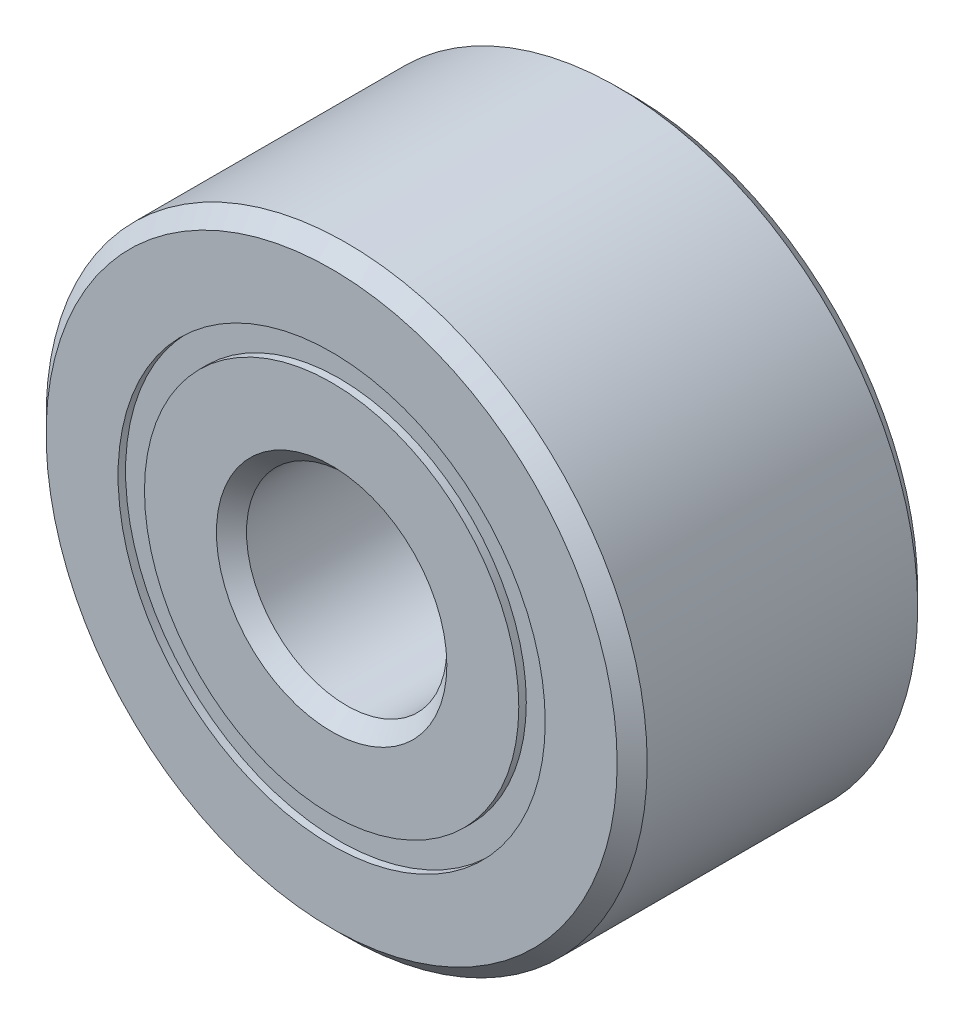
ISO-10303-21;
HEADER;
FILE_DESCRIPTION(('STEP AP214'),'2;1');
FILE_NAME('part.step','',(''),(''),'','','');
FILE_SCHEMA(('AUTOMOTIVE_DESIGN { 1 0 10303 214 1 1 1 1 }'));
ENDSEC;
DATA;
#1=APPLICATION_CONTEXT('core data for automotive mechanical design processes');
#2=APPLICATION_PROTOCOL_DEFINITION('international standard','automotive_design',2000,#1);
#3=PRODUCT_CONTEXT('',#1,'mechanical');
#4=PRODUCT('Part','Part','',(#3));
#5=PRODUCT_RELATED_PRODUCT_CATEGORY('part','',(#4));
#6=PRODUCT_DEFINITION_FORMATION('','',#4);
#7=PRODUCT_DEFINITION_CONTEXT('part definition',#1,'design');
#8=PRODUCT_DEFINITION('design','',#6,#7);
#9=PRODUCT_DEFINITION_SHAPE('','',#8);
#10=(LENGTH_UNIT() NAMED_UNIT(*) SI_UNIT(.MILLI.,.METRE.));
#11=(NAMED_UNIT(*) PLANE_ANGLE_UNIT() SI_UNIT($,.RADIAN.));
#12=(NAMED_UNIT(*) SI_UNIT($,.STERADIAN.) SOLID_ANGLE_UNIT());
#13=UNCERTAINTY_MEASURE_WITH_UNIT(LENGTH_MEASURE(1.E-05),#10,'distance_accuracy_value','');
#14=(GEOMETRIC_REPRESENTATION_CONTEXT(3) GLOBAL_UNCERTAINTY_ASSIGNED_CONTEXT((#13)) GLOBAL_UNIT_ASSIGNED_CONTEXT((#10,
#11,#12)) REPRESENTATION_CONTEXT('',''));
#15=CARTESIAN_POINT('',(0.,0.,0.));
#16=DIRECTION('',(0.,0.,1.));
#17=DIRECTION('',(1.,0.,0.));
#18=AXIS2_PLACEMENT_3D('',#15,#16,#17);
#19=CARTESIAN_POINT('',(0.,2.13186813186813,-1.425));
#20=DIRECTION('',(0.,0.,1.));
#21=DIRECTION('',(1.,0.,0.));
#22=AXIS2_PLACEMENT_3D('',#19,#20,#21);
#23=PLANE('',#22);
#24=CARTESIAN_POINT('',(0.,0.,-1.425));
#25=DIRECTION('',(0.,0.,1.));
#26=DIRECTION('',(1.,0.,0.));
#27=AXIS2_PLACEMENT_3D('',#24,#25,#26);
#28=CIRCLE('',#27,2.13186813186813);
#29=CARTESIAN_POINT('',(2.13186813186813,0.,-1.425));
#30=VERTEX_POINT('',#29);
#31=EDGE_CURVE('E55',#30,#30,#28,.T.);
#32=ORIENTED_EDGE('',*,*,#31,.F.);
#33=EDGE_LOOP('',(#32));
#34=FACE_BOUND('',#33,.T.);
#35=CARTESIAN_POINT('',(0.,0.,-1.425));
#36=DIRECTION('',(0.,0.,1.));
#37=DIRECTION('',(1.,0.,0.));
#38=AXIS2_PLACEMENT_3D('',#35,#36,#37);
#39=CIRCLE('',#38,1.86813186813187);
#40=CARTESIAN_POINT('',(1.86813186813187,0.,-1.425));
#41=VERTEX_POINT('',#40);
#42=EDGE_CURVE('E11',#41,#41,#39,.T.);
#43=ORIENTED_EDGE('',*,*,#42,.T.);
#44=EDGE_LOOP('',(#43));
#45=FACE_BOUND('',#44,.T.);
#46=ADVANCED_FACE('F41',(#34,#45),#23,.F.);
#47=CARTESIAN_POINT('',(0.,0.,1.5));
#48=DIRECTION('',(0.,0.,1.));
#49=DIRECTION('',(1.,0.,0.));
#50=AXIS2_PLACEMENT_3D('',#47,#48,#49);
#51=CYLINDRICAL_SURFACE('',#50,1.86813186813187);
#52=ORIENTED_EDGE('',*,*,#42,.F.);
#53=EDGE_LOOP('',(#52));
#54=FACE_BOUND('',#53,.T.);
#55=CARTESIAN_POINT('',(0.,0.,-0.679583437590143));
#56=DIRECTION('',(0.,0.,1.));
#57=DIRECTION('',(1.,0.,0.));
#58=AXIS2_PLACEMENT_3D('',#55,#56,#57);
#59=CIRCLE('',#58,1.86813186813187);
#60=CARTESIAN_POINT('',(1.86813186813187,0.,-0.679583437590143));
#61=VERTEX_POINT('',#60);
#62=EDGE_CURVE('E47',#61,#61,#59,.T.);
#63=ORIENTED_EDGE('',*,*,#62,.T.);
#64=EDGE_LOOP('',(#63));
#65=FACE_BOUND('',#64,.T.);
#66=ADVANCED_FACE('F64',(#54,#65),#51,.F.);
#67=CARTESIAN_POINT('',(0.,2.13186813186813,-0.679583437590143));
#68=DIRECTION('',(0.,0.,-1.));
#69=DIRECTION('',(-1.,0.,0.));
#70=AXIS2_PLACEMENT_3D('',#67,#68,#69);
#71=PLANE('',#70);
#72=ORIENTED_EDGE('',*,*,#62,.F.);
#73=EDGE_LOOP('',(#72));
#74=FACE_BOUND('',#73,.T.);
#75=CARTESIAN_POINT('',(0.,0.,-0.679583437590143));
#76=DIRECTION('',(0.,0.,1.));
#77=DIRECTION('',(1.,0.,0.));
#78=AXIS2_PLACEMENT_3D('',#75,#76,#77);
#79=CIRCLE('',#78,2.13186813186813);
#80=CARTESIAN_POINT('',(2.13186813186813,0.,-0.679583437590143));
#81=VERTEX_POINT('',#80);
#82=EDGE_CURVE('E51',#81,#81,#79,.T.);
#83=ORIENTED_EDGE('',*,*,#82,.T.);
#84=EDGE_LOOP('',(#83));
#85=FACE_BOUND('',#84,.T.);
#86=ADVANCED_FACE('F68',(#74,#85),#71,.F.);
#87=CARTESIAN_POINT('',(0.,0.,1.5));
#88=DIRECTION('',(0.,0.,1.));
#89=DIRECTION('',(1.,0.,0.));
#90=AXIS2_PLACEMENT_3D('',#87,#88,#89);
#91=CYLINDRICAL_SURFACE('',#90,2.13186813186813);
#92=ORIENTED_EDGE('',*,*,#82,.F.);
#93=EDGE_LOOP('',(#92));
#94=FACE_BOUND('',#93,.T.);
#95=ORIENTED_EDGE('',*,*,#31,.T.);
#96=EDGE_LOOP('',(#95));
#97=FACE_BOUND('',#96,.T.);
#98=ADVANCED_FACE('F61',(#94,#97),#91,.T.);
#99=CLOSED_SHELL('',(#46,#66,#86,#98));
#100=MANIFOLD_SOLID_BREP('B2',#99);
#101=CARTESIAN_POINT('',(0.,2.13186813186813,1.425));
#102=DIRECTION('',(0.,0.,-1.));
#103=DIRECTION('',(-1.,0.,0.));
#104=AXIS2_PLACEMENT_3D('',#101,#102,#103);
#105=PLANE('',#104);
#106=CARTESIAN_POINT('',(0.,0.,1.425));
#107=DIRECTION('',(0.,0.,1.));
#108=DIRECTION('',(1.,0.,0.));
#109=AXIS2_PLACEMENT_3D('',#106,#107,#108);
#110=CIRCLE('',#109,1.86813186813187);
#111=CARTESIAN_POINT('',(1.86813186813187,0.,1.425));
#112=VERTEX_POINT('',#111);
#113=EDGE_CURVE('E40',#112,#112,#110,.T.);
#114=ORIENTED_EDGE('',*,*,#113,.F.);
#115=EDGE_LOOP('',(#114));
#116=FACE_BOUND('',#115,.T.);
#117=CARTESIAN_POINT('',(0.,0.,1.425));
#118=DIRECTION('',(0.,0.,1.));
#119=DIRECTION('',(1.,0.,0.));
#120=AXIS2_PLACEMENT_3D('',#117,#118,#119);
#121=CIRCLE('',#120,2.13186813186813);
#122=CARTESIAN_POINT('',(2.13186813186813,0.,1.425));
#123=VERTEX_POINT('',#122);
#124=EDGE_CURVE('E122',#123,#123,#121,.T.);
#125=ORIENTED_EDGE('',*,*,#124,.T.);
#126=EDGE_LOOP('',(#125));
#127=FACE_BOUND('',#126,.T.);
#128=ADVANCED_FACE('F108',(#116,#127),#105,.F.);
#129=CARTESIAN_POINT('',(0.,0.,1.5));
#130=DIRECTION('',(0.,0.,1.));
#131=DIRECTION('',(1.,0.,0.));
#132=AXIS2_PLACEMENT_3D('',#129,#130,#131);
#133=CYLINDRICAL_SURFACE('',#132,1.86813186813187);
#134=CARTESIAN_POINT('',(0.,0.,0.679583437590142));
#135=DIRECTION('',(0.,0.,1.));
#136=DIRECTION('',(1.,0.,0.));
#137=AXIS2_PLACEMENT_3D('',#134,#135,#136);
#138=CIRCLE('',#137,1.86813186813187);
#139=CARTESIAN_POINT('',(1.86813186813187,0.,0.679583437590142));
#140=VERTEX_POINT('',#139);
#141=EDGE_CURVE('E114',#140,#140,#138,.T.);
#142=ORIENTED_EDGE('',*,*,#141,.F.);
#143=EDGE_LOOP('',(#142));
#144=FACE_BOUND('',#143,.T.);
#145=ORIENTED_EDGE('',*,*,#113,.T.);
#146=EDGE_LOOP('',(#145));
#147=FACE_BOUND('',#146,.T.);
#148=ADVANCED_FACE('F137',(#144,#147),#133,.F.);
#149=CARTESIAN_POINT('',(0.,2.13186813186813,0.679583437590142));
#150=DIRECTION('',(0.,0.,1.));
#151=DIRECTION('',(1.,0.,0.));
#152=AXIS2_PLACEMENT_3D('',#149,#150,#151);
#153=PLANE('',#152);
#154=CARTESIAN_POINT('',(0.,0.,0.679583437590142));
#155=DIRECTION('',(0.,0.,1.));
#156=DIRECTION('',(1.,0.,0.));
#157=AXIS2_PLACEMENT_3D('',#154,#155,#156);
#158=CIRCLE('',#157,2.13186813186813);
#159=CARTESIAN_POINT('',(2.13186813186813,0.,0.679583437590142));
#160=VERTEX_POINT('',#159);
#161=EDGE_CURVE('E118',#160,#160,#158,.T.);
#162=ORIENTED_EDGE('',*,*,#161,.F.);
#163=EDGE_LOOP('',(#162));
#164=FACE_BOUND('',#163,.T.);
#165=ORIENTED_EDGE('',*,*,#141,.T.);
#166=EDGE_LOOP('',(#165));
#167=FACE_BOUND('',#166,.T.);
#168=ADVANCED_FACE('F132',(#164,#167),#153,.F.);
#169=CARTESIAN_POINT('',(0.,0.,1.5));
#170=DIRECTION('',(0.,0.,1.));
#171=DIRECTION('',(1.,0.,0.));
#172=AXIS2_PLACEMENT_3D('',#169,#170,#171);
#173=CYLINDRICAL_SURFACE('',#172,2.13186813186813);
#174=ORIENTED_EDGE('',*,*,#124,.F.);
#175=EDGE_LOOP('',(#174));
#176=FACE_BOUND('',#175,.T.);
#177=ORIENTED_EDGE('',*,*,#161,.T.);
#178=EDGE_LOOP('',(#177));
#179=FACE_BOUND('',#178,.T.);
#180=ADVANCED_FACE('F129',(#176,#179),#173,.T.);
#181=CLOSED_SHELL('',(#128,#148,#168,#180));
#182=MANIFOLD_SOLID_BREP('B6',#181);
#183=CARTESIAN_POINT('',(-0.999999999999978,1.73205080756889,0.));
#184=DIRECTION('',(0.,0.,1.));
#185=DIRECTION('',(-0.499999999999989,0.866025403784445,0.));
#186=AXIS2_PLACEMENT_3D('',#183,#184,#185);
#187=SPHERICAL_SURFACE('',#186,0.679583437590143);
#188=CARTESIAN_POINT('',(-0.999999999999978,1.73205080756889,0.679583437590142));
#189=VERTEX_POINT('',#188);
#190=VERTEX_LOOP('',#189);
#191=FACE_BOUND('',#190,.T.);
#192=ADVANCED_FACE('F175',(#191),#187,.T.);
#193=CLOSED_SHELL('',(#192));
#194=MANIFOLD_SOLID_BREP('B35',#193);
#195=CARTESIAN_POINT('',(-1.73205080756887,1.00000000000002,0.));
#196=DIRECTION('',(0.,0.,1.));
#197=DIRECTION('',(-0.866025403784433,0.50000000000001,0.));
#198=AXIS2_PLACEMENT_3D('',#195,#196,#197);
#199=SPHERICAL_SURFACE('',#198,0.679583437590143);
#200=CARTESIAN_POINT('',(-1.73205080756887,1.00000000000002,0.679583437590142));
#201=VERTEX_POINT('',#200);
#202=VERTEX_LOOP('',#201);
#203=FACE_BOUND('',#202,.T.);
#204=ADVANCED_FACE('F195',(#203),#199,.T.);
#205=CLOSED_SHELL('',(#204));
#206=MANIFOLD_SOLID_BREP('B104',#205);
#207=CARTESIAN_POINT('',(-2.,0.,0.));
#208=DIRECTION('',(0.,0.,1.));
#209=DIRECTION('',(-1.,0.,0.));
#210=AXIS2_PLACEMENT_3D('',#207,#208,#209);
#211=SPHERICAL_SURFACE('',#210,0.679583437590143);
#212=CARTESIAN_POINT('',(-2.,0.,0.679583437590142));
#213=VERTEX_POINT('',#212);
#214=VERTEX_LOOP('',#213);
#215=FACE_BOUND('',#214,.T.);
#216=ADVANCED_FACE('F215',(#215),#211,.T.);
#217=CLOSED_SHELL('',(#216));
#218=MANIFOLD_SOLID_BREP('B171',#217);
#219=CARTESIAN_POINT('',(-1.73205080756889,-0.999999999999984,0.));
#220=DIRECTION('',(0.,0.,1.));
#221=DIRECTION('',(-0.866025403784443,-0.499999999999992,0.));
#222=AXIS2_PLACEMENT_3D('',#219,#220,#221);
#223=SPHERICAL_SURFACE('',#222,0.679583437590143);
#224=CARTESIAN_POINT('',(-1.73205080756889,-0.999999999999984,0.679583437590142));
#225=VERTEX_POINT('',#224);
#226=VERTEX_LOOP('',#225);
#227=FACE_BOUND('',#226,.T.);
#228=ADVANCED_FACE('F235',(#227),#223,.T.);
#229=CLOSED_SHELL('',(#228));
#230=MANIFOLD_SOLID_BREP('B191',#229);
#231=CARTESIAN_POINT('',(-1.00000000000001,-1.73205080756887,0.));
#232=DIRECTION('',(0.,0.,1.));
#233=DIRECTION('',(-0.500000000000007,-0.866025403784435,0.));
#234=AXIS2_PLACEMENT_3D('',#231,#232,#233);
#235=SPHERICAL_SURFACE('',#234,0.679583437590143);
#236=CARTESIAN_POINT('',(-1.00000000000001,-1.73205080756887,0.679583437590142));
#237=VERTEX_POINT('',#236);
#238=VERTEX_LOOP('',#237);
#239=FACE_BOUND('',#238,.T.);
#240=ADVANCED_FACE('F255',(#239),#235,.T.);
#241=CLOSED_SHELL('',(#240));
#242=MANIFOLD_SOLID_BREP('B211',#241);
#243=CARTESIAN_POINT('',(0.,-2.,0.));
#244=DIRECTION('',(0.,0.,1.));
#245=DIRECTION('',(0.,-1.,0.));
#246=AXIS2_PLACEMENT_3D('',#243,#244,#245);
#247=SPHERICAL_SURFACE('',#246,0.679583437590143);
#248=CARTESIAN_POINT('',(0.,-2.,0.679583437590142));
#249=VERTEX_POINT('',#248);
#250=VERTEX_LOOP('',#249);
#251=FACE_BOUND('',#250,.T.);
#252=ADVANCED_FACE('F275',(#251),#247,.T.);
#253=CLOSED_SHELL('',(#252));
#254=MANIFOLD_SOLID_BREP('B231',#253);
#255=CARTESIAN_POINT('',(0.99999999999999,-1.73205080756888,0.));
#256=DIRECTION('',(0.,0.,1.));
#257=DIRECTION('',(0.499999999999995,-0.866025403784442,0.));
#258=AXIS2_PLACEMENT_3D('',#255,#256,#257);
#259=SPHERICAL_SURFACE('',#258,0.679583437590143);
#260=CARTESIAN_POINT('',(0.99999999999999,-1.73205080756888,0.679583437590142));
#261=VERTEX_POINT('',#260);
#262=VERTEX_LOOP('',#261);
#263=FACE_BOUND('',#262,.T.);
#264=ADVANCED_FACE('F295',(#263),#259,.T.);
#265=CLOSED_SHELL('',(#264));
#266=MANIFOLD_SOLID_BREP('B251',#265);
#267=CARTESIAN_POINT('',(1.73205080756887,-1.00000000000001,0.));
#268=DIRECTION('',(0.,0.,1.));
#269=DIRECTION('',(0.866025403784436,-0.500000000000004,0.));
#270=AXIS2_PLACEMENT_3D('',#267,#268,#269);
#271=SPHERICAL_SURFACE('',#270,0.679583437590143);
#272=CARTESIAN_POINT('',(1.73205080756887,-1.00000000000001,0.679583437590142));
#273=VERTEX_POINT('',#272);
#274=VERTEX_LOOP('',#273);
#275=FACE_BOUND('',#274,.T.);
#276=ADVANCED_FACE('F315',(#275),#271,.T.);
#277=CLOSED_SHELL('',(#276));
#278=MANIFOLD_SOLID_BREP('B271',#277);
#279=CARTESIAN_POINT('',(2.,0.,0.));
#280=DIRECTION('',(0.,0.,1.));
#281=DIRECTION('',(1.,0.,0.));
#282=AXIS2_PLACEMENT_3D('',#279,#280,#281);
#283=SPHERICAL_SURFACE('',#282,0.679583437590143);
#284=CARTESIAN_POINT('',(2.,0.,0.679583437590142));
#285=VERTEX_POINT('',#284);
#286=VERTEX_LOOP('',#285);
#287=FACE_BOUND('',#286,.T.);
#288=ADVANCED_FACE('F335',(#287),#283,.T.);
#289=CLOSED_SHELL('',(#288));
#290=MANIFOLD_SOLID_BREP('B291',#289);
#291=CARTESIAN_POINT('',(1.73205080756888,0.999999999999996,0.));
#292=DIRECTION('',(0.,0.,1.));
#293=DIRECTION('',(0.86602540378444,0.499999999999998,0.));
#294=AXIS2_PLACEMENT_3D('',#291,#292,#293);
#295=SPHERICAL_SURFACE('',#294,0.679583437590143);
#296=CARTESIAN_POINT('',(1.73205080756888,0.999999999999996,0.679583437590142));
#297=VERTEX_POINT('',#296);
#298=VERTEX_LOOP('',#297);
#299=FACE_BOUND('',#298,.T.);
#300=ADVANCED_FACE('F355',(#299),#295,.T.);
#301=CLOSED_SHELL('',(#300));
#302=MANIFOLD_SOLID_BREP('B311',#301);
#303=CARTESIAN_POINT('',(1.,1.73205080756888,0.));
#304=DIRECTION('',(0.,0.,1.));
#305=DIRECTION('',(0.500000000000001,0.866025403784438,0.));
#306=AXIS2_PLACEMENT_3D('',#303,#304,#305);
#307=SPHERICAL_SURFACE('',#306,0.679583437590143);
#308=CARTESIAN_POINT('',(1.,1.73205080756888,0.679583437590142));
#309=VERTEX_POINT('',#308);
#310=VERTEX_LOOP('',#309);
#311=FACE_BOUND('',#310,.T.);
#312=ADVANCED_FACE('F375',(#311),#307,.T.);
#313=CLOSED_SHELL('',(#312));
#314=MANIFOLD_SOLID_BREP('B331',#313);
#315=CARTESIAN_POINT('',(0.,2.,0.));
#316=DIRECTION('',(0.,0.,1.));
#317=DIRECTION('',(0.,1.,0.));
#318=AXIS2_PLACEMENT_3D('',#315,#316,#317);
#319=SPHERICAL_SURFACE('',#318,0.679583437590143);
#320=CARTESIAN_POINT('',(0.,2.,0.679583437590142));
#321=VERTEX_POINT('',#320);
#322=VERTEX_LOOP('',#321);
#323=FACE_BOUND('',#322,.T.);
#324=ADVANCED_FACE('F397',(#323),#319,.T.);
#325=CLOSED_SHELL('',(#324));
#326=MANIFOLD_SOLID_BREP('B351',#325);
#327=CARTESIAN_POINT('',(0.,1.86813186813187,1.5));
#328=DIRECTION('',(0.,0.,-1.));
#329=DIRECTION('',(-1.,0.,0.));
#330=AXIS2_PLACEMENT_3D('',#327,#328,#329);
#331=PLANE('',#330);
#332=CARTESIAN_POINT('',(0.,0.,1.5));
#333=DIRECTION('',(0.,0.,1.));
#334=DIRECTION('',(1.,0.,0.));
#335=AXIS2_PLACEMENT_3D('',#332,#333,#334);
#336=CIRCLE('',#335,1.15);
#337=CARTESIAN_POINT('',(1.15,0.,1.5));
#338=VERTEX_POINT('',#337);
#339=EDGE_CURVE('E444',#338,#338,#336,.T.);
#340=ORIENTED_EDGE('',*,*,#339,.F.);
#341=EDGE_LOOP('',(#340));
#342=FACE_BOUND('',#341,.T.);
#343=CARTESIAN_POINT('',(0.,0.,1.5));
#344=DIRECTION('',(0.,0.,1.));
#345=DIRECTION('',(1.,0.,0.));
#346=AXIS2_PLACEMENT_3D('',#343,#344,#345);
#347=CIRCLE('',#346,1.86813186813187);
#348=CARTESIAN_POINT('',(1.86813186813187,0.,1.5));
#349=VERTEX_POINT('',#348);
#350=EDGE_CURVE('E396',#349,#349,#347,.T.);
#351=ORIENTED_EDGE('',*,*,#350,.T.);
#352=EDGE_LOOP('',(#351));
#353=FACE_BOUND('',#352,.T.);
#354=ADVANCED_FACE('F416',(#342,#353),#331,.F.);
#355=CARTESIAN_POINT('',(0.,0.,1.5));
#356=DIRECTION('',(0.,0.,1.));
#357=DIRECTION('',(1.,0.,0.));
#358=AXIS2_PLACEMENT_3D('',#355,#356,#357);
#359=CYLINDRICAL_SURFACE('',#358,1.86813186813187);
#360=ORIENTED_EDGE('',*,*,#350,.F.);
#361=EDGE_LOOP('',(#360));
#362=FACE_BOUND('',#361,.T.);
#363=CARTESIAN_POINT('',(0.,0.,0.666666666666666));
#364=DIRECTION('',(0.,0.,1.));
#365=DIRECTION('',(1.,0.,0.));
#366=AXIS2_PLACEMENT_3D('',#363,#364,#365);
#367=CIRCLE('',#366,1.86813186813187);
#368=CARTESIAN_POINT('',(1.86813186813187,0.,0.666666666666666));
#369=VERTEX_POINT('',#368);
#370=EDGE_CURVE('E422',#369,#369,#367,.T.);
#371=ORIENTED_EDGE('',*,*,#370,.T.);
#372=EDGE_LOOP('',(#371));
#373=FACE_BOUND('',#372,.T.);
#374=ADVANCED_FACE('F451',(#362,#373),#359,.T.);
#375=CARTESIAN_POINT('',(0.,0.,0.));
#376=DIRECTION('',(0.,0.,1.));
#377=DIRECTION('',(1.,0.,0.));
#378=AXIS2_PLACEMENT_3D('',#375,#376,#377);
#379=TOROIDAL_SURFACE('',#378,2.,0.679583437590142);
#380=ORIENTED_EDGE('',*,*,#370,.F.);
#381=EDGE_LOOP('',(#380));
#382=FACE_BOUND('',#381,.T.);
#383=CARTESIAN_POINT('',(0.,0.,-0.666666666666667));
#384=DIRECTION('',(0.,0.,1.));
#385=DIRECTION('',(1.,0.,0.));
#386=AXIS2_PLACEMENT_3D('',#383,#384,#385);
#387=CIRCLE('',#386,1.86813186813187);
#388=CARTESIAN_POINT('',(1.86813186813187,0.,-0.666666666666667));
#389=VERTEX_POINT('',#388);
#390=EDGE_CURVE('E426',#389,#389,#387,.T.);
#391=ORIENTED_EDGE('',*,*,#390,.T.);
#392=EDGE_LOOP('',(#391));
#393=FACE_BOUND('',#392,.T.);
#394=ADVANCED_FACE('F455',(#382,#393),#379,.F.);
#395=CARTESIAN_POINT('',(0.,0.,1.5));
#396=DIRECTION('',(0.,0.,1.));
#397=DIRECTION('',(1.,0.,0.));
#398=AXIS2_PLACEMENT_3D('',#395,#396,#397);
#399=CYLINDRICAL_SURFACE('',#398,1.86813186813187);
#400=ORIENTED_EDGE('',*,*,#390,.F.);
#401=EDGE_LOOP('',(#400));
#402=FACE_BOUND('',#401,.T.);
#403=CARTESIAN_POINT('',(0.,0.,-1.5));
#404=DIRECTION('',(0.,0.,1.));
#405=DIRECTION('',(1.,0.,0.));
#406=AXIS2_PLACEMENT_3D('',#403,#404,#405);
#407=CIRCLE('',#406,1.86813186813187);
#408=CARTESIAN_POINT('',(1.86813186813187,0.,-1.5));
#409=VERTEX_POINT('',#408);
#410=EDGE_CURVE('E430',#409,#409,#407,.T.);
#411=ORIENTED_EDGE('',*,*,#410,.T.);
#412=EDGE_LOOP('',(#411));
#413=FACE_BOUND('',#412,.T.);
#414=ADVANCED_FACE('F460',(#402,#413),#399,.T.);
#415=CARTESIAN_POINT('',(0.,1.15,-1.5));
#416=DIRECTION('',(0.,0.,1.));
#417=DIRECTION('',(1.,0.,0.));
#418=AXIS2_PLACEMENT_3D('',#415,#416,#417);
#419=PLANE('',#418);
#420=ORIENTED_EDGE('',*,*,#410,.F.);
#421=EDGE_LOOP('',(#420));
#422=FACE_BOUND('',#421,.T.);
#423=CARTESIAN_POINT('',(0.,0.,-1.5));
#424=DIRECTION('',(0.,0.,1.));
#425=DIRECTION('',(1.,0.,0.));
#426=AXIS2_PLACEMENT_3D('',#423,#424,#425);
#427=CIRCLE('',#426,1.15);
#428=CARTESIAN_POINT('',(1.15,0.,-1.5));
#429=VERTEX_POINT('',#428);
#430=EDGE_CURVE('E435',#429,#429,#427,.T.);
#431=ORIENTED_EDGE('',*,*,#430,.T.);
#432=EDGE_LOOP('',(#431));
#433=FACE_BOUND('',#432,.T.);
#434=ADVANCED_FACE('F466',(#422,#433),#419,.F.);
#435=CARTESIAN_POINT('',(0.,0.,-1.35));
#436=DIRECTION('',(0.,0.,-1.));
#437=DIRECTION('',(-1.,0.,0.));
#438=AXIS2_PLACEMENT_3D('',#435,#436,#437);
#439=CONICAL_SURFACE('',#438,1.,0.785398163397449);
#440=ORIENTED_EDGE('',*,*,#430,.F.);
#441=EDGE_LOOP('',(#440));
#442=FACE_BOUND('',#441,.T.);
#443=CARTESIAN_POINT('',(0.,0.,-1.35));
#444=DIRECTION('',(0.,0.,1.));
#445=DIRECTION('',(1.,0.,0.));
#446=AXIS2_PLACEMENT_3D('',#443,#444,#445);
#447=CIRCLE('',#446,1.);
#448=CARTESIAN_POINT('',(1.,0.,-1.35));
#449=VERTEX_POINT('',#448);
#450=EDGE_CURVE('E438',#449,#449,#447,.T.);
#451=ORIENTED_EDGE('',*,*,#450,.T.);
#452=EDGE_LOOP('',(#451));
#453=FACE_BOUND('',#452,.T.);
#454=ADVANCED_FACE('F470',(#442,#453),#439,.F.);
#455=CARTESIAN_POINT('',(0.,0.,1.5));
#456=DIRECTION('',(0.,0.,1.));
#457=DIRECTION('',(1.,0.,0.));
#458=AXIS2_PLACEMENT_3D('',#455,#456,#457);
#459=CYLINDRICAL_SURFACE('',#458,1.);
#460=ORIENTED_EDGE('',*,*,#450,.F.);
#461=EDGE_LOOP('',(#460));
#462=FACE_BOUND('',#461,.T.);
#463=CARTESIAN_POINT('',(0.,0.,1.35));
#464=DIRECTION('',(0.,0.,1.));
#465=DIRECTION('',(1.,0.,0.));
#466=AXIS2_PLACEMENT_3D('',#463,#464,#465);
#467=CIRCLE('',#466,1.);
#468=CARTESIAN_POINT('',(1.,0.,1.35));
#469=VERTEX_POINT('',#468);
#470=EDGE_CURVE('E441',#469,#469,#467,.T.);
#471=ORIENTED_EDGE('',*,*,#470,.T.);
#472=EDGE_LOOP('',(#471));
#473=FACE_BOUND('',#472,.T.);
#474=ADVANCED_FACE('F474',(#462,#473),#459,.F.);
#475=CARTESIAN_POINT('',(0.,0.,1.5));
#476=DIRECTION('',(0.,0.,1.));
#477=DIRECTION('',(1.,0.,0.));
#478=AXIS2_PLACEMENT_3D('',#475,#476,#477);
#479=CONICAL_SURFACE('',#478,1.15,0.785398163397448);
#480=ORIENTED_EDGE('',*,*,#470,.F.);
#481=EDGE_LOOP('',(#480));
#482=FACE_BOUND('',#481,.T.);
#483=ORIENTED_EDGE('',*,*,#339,.T.);
#484=EDGE_LOOP('',(#483));
#485=FACE_BOUND('',#484,.T.);
#486=ADVANCED_FACE('F448',(#482,#485),#479,.F.);
#487=CLOSED_SHELL('',(#354,#374,#394,#414,#434,#454,#474,#486));
#488=MANIFOLD_SOLID_BREP('B371',#487);
#489=CARTESIAN_POINT('',(0.,0.,1.35));
#490=DIRECTION('',(0.,0.,-1.));
#491=DIRECTION('',(-1.,0.,0.));
#492=AXIS2_PLACEMENT_3D('',#489,#490,#491);
#493=CONICAL_SURFACE('',#492,3.,0.78539816339745);
#494=CARTESIAN_POINT('',(0.,0.,1.5));
#495=DIRECTION('',(0.,0.,1.));
#496=DIRECTION('',(1.,0.,0.));
#497=AXIS2_PLACEMENT_3D('',#494,#495,#496);
#498=CIRCLE('',#497,2.85);
#499=CARTESIAN_POINT('',(2.85,0.,1.5));
#500=VERTEX_POINT('',#499);
#501=EDGE_CURVE('E565',#500,#500,#498,.T.);
#502=ORIENTED_EDGE('',*,*,#501,.F.);
#503=EDGE_LOOP('',(#502));
#504=FACE_BOUND('',#503,.T.);
#505=CARTESIAN_POINT('',(0.,0.,1.35));
#506=DIRECTION('',(0.,0.,1.));
#507=DIRECTION('',(1.,0.,0.));
#508=AXIS2_PLACEMENT_3D('',#505,#506,#507);
#509=CIRCLE('',#508,3.);
#510=CARTESIAN_POINT('',(3.,0.,1.35));
#511=VERTEX_POINT('',#510);
#512=EDGE_CURVE('E415',#511,#511,#509,.T.);
#513=ORIENTED_EDGE('',*,*,#512,.T.);
#514=EDGE_LOOP('',(#513));
#515=FACE_BOUND('',#514,.T.);
#516=ADVANCED_FACE('F537',(#504,#515),#493,.T.);
#517=CARTESIAN_POINT('',(0.,0.,1.5));
#518=DIRECTION('',(0.,0.,1.));
#519=DIRECTION('',(1.,0.,0.));
#520=AXIS2_PLACEMENT_3D('',#517,#518,#519);
#521=CYLINDRICAL_SURFACE('',#520,3.);
#522=ORIENTED_EDGE('',*,*,#512,.F.);
#523=EDGE_LOOP('',(#522));
#524=FACE_BOUND('',#523,.T.);
#525=CARTESIAN_POINT('',(0.,0.,-1.35));
#526=DIRECTION('',(0.,0.,1.));
#527=DIRECTION('',(1.,0.,0.));
#528=AXIS2_PLACEMENT_3D('',#525,#526,#527);
#529=CIRCLE('',#528,3.);
#530=CARTESIAN_POINT('',(3.,0.,-1.35));
#531=VERTEX_POINT('',#530);
#532=EDGE_CURVE('E543',#531,#531,#529,.T.);
#533=ORIENTED_EDGE('',*,*,#532,.T.);
#534=EDGE_LOOP('',(#533));
#535=FACE_BOUND('',#534,.T.);
#536=ADVANCED_FACE('F572',(#524,#535),#521,.T.);
#537=CARTESIAN_POINT('',(0.,0.,-1.5));
#538=DIRECTION('',(0.,0.,1.));
#539=DIRECTION('',(1.,0.,0.));
#540=AXIS2_PLACEMENT_3D('',#537,#538,#539);
#541=CONICAL_SURFACE('',#540,2.85,0.78539816339745);
#542=ORIENTED_EDGE('',*,*,#532,.F.);
#543=EDGE_LOOP('',(#542));
#544=FACE_BOUND('',#543,.T.);
#545=CARTESIAN_POINT('',(0.,0.,-1.5));
#546=DIRECTION('',(0.,0.,1.));
#547=DIRECTION('',(1.,0.,0.));
#548=AXIS2_PLACEMENT_3D('',#545,#546,#547);
#549=CIRCLE('',#548,2.85);
#550=CARTESIAN_POINT('',(2.85,0.,-1.5));
#551=VERTEX_POINT('',#550);
#552=EDGE_CURVE('E547',#551,#551,#549,.T.);
#553=ORIENTED_EDGE('',*,*,#552,.T.);
#554=EDGE_LOOP('',(#553));
#555=FACE_BOUND('',#554,.T.);
#556=ADVANCED_FACE('F576',(#544,#555),#541,.T.);
#557=CARTESIAN_POINT('',(0.,2.85,-1.5));
#558=DIRECTION('',(0.,0.,1.));
#559=DIRECTION('',(1.,0.,0.));
#560=AXIS2_PLACEMENT_3D('',#557,#558,#559);
#561=PLANE('',#560);
#562=ORIENTED_EDGE('',*,*,#552,.F.);
#563=EDGE_LOOP('',(#562));
#564=FACE_BOUND('',#563,.T.);
#565=CARTESIAN_POINT('',(0.,0.,-1.5));
#566=DIRECTION('',(0.,0.,1.));
#567=DIRECTION('',(1.,0.,0.));
#568=AXIS2_PLACEMENT_3D('',#565,#566,#567);
#569=CIRCLE('',#568,2.13186813186813);
#570=CARTESIAN_POINT('',(2.13186813186813,0.,-1.5));
#571=VERTEX_POINT('',#570);
#572=EDGE_CURVE('E551',#571,#571,#569,.T.);
#573=ORIENTED_EDGE('',*,*,#572,.T.);
#574=EDGE_LOOP('',(#573));
#575=FACE_BOUND('',#574,.T.);
#576=ADVANCED_FACE('F581',(#564,#575),#561,.F.);
#577=CARTESIAN_POINT('',(0.,0.,1.5));
#578=DIRECTION('',(0.,0.,1.));
#579=DIRECTION('',(1.,0.,0.));
#580=AXIS2_PLACEMENT_3D('',#577,#578,#579);
#581=CYLINDRICAL_SURFACE('',#580,2.13186813186813);
#582=ORIENTED_EDGE('',*,*,#572,.F.);
#583=EDGE_LOOP('',(#582));
#584=FACE_BOUND('',#583,.T.);
#585=CARTESIAN_POINT('',(0.,0.,-0.666666666666667));
#586=DIRECTION('',(0.,0.,1.));
#587=DIRECTION('',(1.,0.,0.));
#588=AXIS2_PLACEMENT_3D('',#585,#586,#587);
#589=CIRCLE('',#588,2.13186813186813);
#590=CARTESIAN_POINT('',(2.13186813186813,0.,-0.666666666666667));
#591=VERTEX_POINT('',#590);
#592=EDGE_CURVE('E556',#591,#591,#589,.T.);
#593=ORIENTED_EDGE('',*,*,#592,.T.);
#594=EDGE_LOOP('',(#593));
#595=FACE_BOUND('',#594,.T.);
#596=ADVANCED_FACE('F587',(#584,#595),#581,.F.);
#597=CARTESIAN_POINT('',(0.,0.,0.));
#598=DIRECTION('',(0.,0.,1.));
#599=DIRECTION('',(1.,0.,0.));
#600=AXIS2_PLACEMENT_3D('',#597,#598,#599);
#601=TOROIDAL_SURFACE('',#600,2.,0.679583437590143);
#602=ORIENTED_EDGE('',*,*,#592,.F.);
#603=EDGE_LOOP('',(#602));
#604=FACE_BOUND('',#603,.T.);
#605=CARTESIAN_POINT('',(0.,0.,0.666666666666666));
#606=DIRECTION('',(0.,0.,1.));
#607=DIRECTION('',(1.,0.,0.));
#608=AXIS2_PLACEMENT_3D('',#605,#606,#607);
#609=CIRCLE('',#608,2.13186813186813);
#610=CARTESIAN_POINT('',(2.13186813186813,0.,0.666666666666666));
#611=VERTEX_POINT('',#610);
#612=EDGE_CURVE('E559',#611,#611,#609,.T.);
#613=ORIENTED_EDGE('',*,*,#612,.T.);
#614=EDGE_LOOP('',(#613));
#615=FACE_BOUND('',#614,.T.);
#616=ADVANCED_FACE('F591',(#604,#615),#601,.F.);
#617=CARTESIAN_POINT('',(0.,0.,1.5));
#618=DIRECTION('',(0.,0.,1.));
#619=DIRECTION('',(1.,0.,0.));
#620=AXIS2_PLACEMENT_3D('',#617,#618,#619);
#621=CYLINDRICAL_SURFACE('',#620,2.13186813186813);
#622=ORIENTED_EDGE('',*,*,#612,.F.);
#623=EDGE_LOOP('',(#622));
#624=FACE_BOUND('',#623,.T.);
#625=CARTESIAN_POINT('',(0.,0.,1.5));
#626=DIRECTION('',(0.,0.,1.));
#627=DIRECTION('',(1.,0.,0.));
#628=AXIS2_PLACEMENT_3D('',#625,#626,#627);
#629=CIRCLE('',#628,2.13186813186813);
#630=CARTESIAN_POINT('',(2.13186813186813,0.,1.5));
#631=VERTEX_POINT('',#630);
#632=EDGE_CURVE('E562',#631,#631,#629,.T.);
#633=ORIENTED_EDGE('',*,*,#632,.T.);
#634=EDGE_LOOP('',(#633));
#635=FACE_BOUND('',#634,.T.);
#636=ADVANCED_FACE('F595',(#624,#635),#621,.F.);
#637=CARTESIAN_POINT('',(0.,2.85,1.5));
#638=DIRECTION('',(0.,0.,-1.));
#639=DIRECTION('',(-1.,0.,0.));
#640=AXIS2_PLACEMENT_3D('',#637,#638,#639);
#641=PLANE('',#640);
#642=ORIENTED_EDGE('',*,*,#632,.F.);
#643=EDGE_LOOP('',(#642));
#644=FACE_BOUND('',#643,.T.);
#645=ORIENTED_EDGE('',*,*,#501,.T.);
#646=EDGE_LOOP('',(#645));
#647=FACE_BOUND('',#646,.T.);
#648=ADVANCED_FACE('F569',(#644,#647),#641,.F.);
#649=CLOSED_SHELL('',(#516,#536,#556,#576,#596,#616,#636,#648));
#650=MANIFOLD_SOLID_BREP('B391',#649);
#651=ADVANCED_BREP_SHAPE_REPRESENTATION('',(#18,#100,#182,#194,#206,#218,#230,#242,#254,#266,
#278,#290,#302,#314,#326,#488,#650),#14);
#652=SHAPE_DEFINITION_REPRESENTATION(#9,#651);
ENDSEC;
END-ISO-10303-21;
